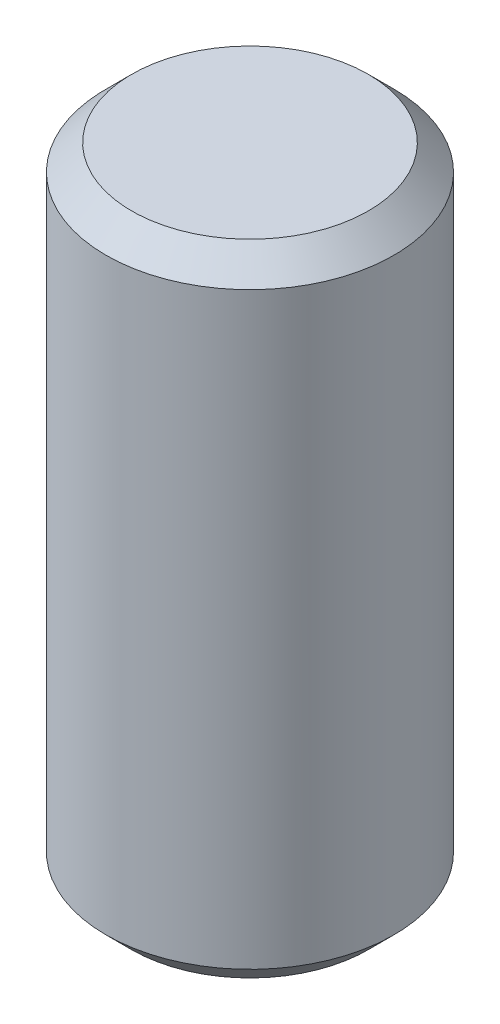
ISO-10303-21;
HEADER;
FILE_DESCRIPTION(('STEP AP214'),'2;1');
FILE_NAME('part.step','',(''),(''),'','','');
FILE_SCHEMA(('AUTOMOTIVE_DESIGN { 1 0 10303 214 1 1 1 1 }'));
ENDSEC;
DATA;
#1=APPLICATION_CONTEXT('core data for automotive mechanical design processes');
#2=APPLICATION_PROTOCOL_DEFINITION('international standard','automotive_design',2000,#1);
#3=PRODUCT_CONTEXT('',#1,'mechanical');
#4=PRODUCT('Part','Part','',(#3));
#5=PRODUCT_RELATED_PRODUCT_CATEGORY('part','',(#4));
#6=PRODUCT_DEFINITION_FORMATION('','',#4);
#7=PRODUCT_DEFINITION_CONTEXT('part definition',#1,'design');
#8=PRODUCT_DEFINITION('design','',#6,#7);
#9=PRODUCT_DEFINITION_SHAPE('','',#8);
#10=(LENGTH_UNIT() NAMED_UNIT(*) SI_UNIT(.MILLI.,.METRE.));
#11=(NAMED_UNIT(*) PLANE_ANGLE_UNIT() SI_UNIT($,.RADIAN.));
#12=(NAMED_UNIT(*) SI_UNIT($,.STERADIAN.) SOLID_ANGLE_UNIT());
#13=UNCERTAINTY_MEASURE_WITH_UNIT(LENGTH_MEASURE(1.E-05),#10,'distance_accuracy_value','');
#14=(GEOMETRIC_REPRESENTATION_CONTEXT(3) GLOBAL_UNCERTAINTY_ASSIGNED_CONTEXT((#13)) GLOBAL_UNIT_ASSIGNED_CONTEXT((#10,
#11,#12)) REPRESENTATION_CONTEXT('',''));
#15=CARTESIAN_POINT('',(0.,0.,0.));
#16=DIRECTION('',(0.,0.,1.));
#17=DIRECTION('',(1.,0.,0.));
#18=AXIS2_PLACEMENT_3D('',#15,#16,#17);
#19=CARTESIAN_POINT('',(0.,-6.35,0.));
#20=DIRECTION('',(0.,1.,0.));
#21=DIRECTION('',(0.,0.,1.));
#22=AXIS2_PLACEMENT_3D('',#19,#20,#21);
#23=PLANE('',#22);
#24=CARTESIAN_POINT('',(0.,-6.35,0.));
#25=DIRECTION('',(0.,1.,0.));
#26=DIRECTION('',(0.,0.,1.));
#27=AXIS2_PLACEMENT_3D('',#24,#25,#26);
#28=CIRCLE('',#27,2.3495);
#29=CARTESIAN_POINT('',(0.,-6.35,2.3495));
#30=VERTEX_POINT('',#29);
#31=EDGE_CURVE('E38',#30,#30,#28,.F.);
#32=ORIENTED_EDGE('',*,*,#31,.T.);
#33=EDGE_LOOP('',(#32));
#34=FACE_BOUND('',#33,.T.);
#35=ADVANCED_FACE('F31',(#34),#23,.F.);
#36=CARTESIAN_POINT('',(0.,6.08020788678209,0.));
#37=DIRECTION('',(0.,1.,0.));
#38=DIRECTION('',(0.,0.,1.));
#39=AXIS2_PLACEMENT_3D('',#36,#37,#38);
#40=CYLINDRICAL_SURFACE('',#39,2.8575);
#41=CARTESIAN_POINT('',(0.,-5.842,0.));
#42=DIRECTION('',(0.,1.,0.));
#43=DIRECTION('',(0.,0.,1.));
#44=AXIS2_PLACEMENT_3D('',#41,#42,#43);
#45=CIRCLE('',#44,2.8575);
#46=CARTESIAN_POINT('',(0.,-5.842,2.8575));
#47=VERTEX_POINT('',#46);
#48=EDGE_CURVE('E42',#47,#47,#45,.T.);
#49=ORIENTED_EDGE('',*,*,#48,.T.);
#50=EDGE_LOOP('',(#49));
#51=FACE_BOUND('',#50,.T.);
#52=CARTESIAN_POINT('',(0.,5.842,0.));
#53=DIRECTION('',(0.,-1.,0.));
#54=DIRECTION('',(0.,0.,-1.));
#55=AXIS2_PLACEMENT_3D('',#52,#53,#54);
#56=CIRCLE('',#55,2.8575);
#57=CARTESIAN_POINT('',(0.,5.842,-2.8575));
#58=VERTEX_POINT('',#57);
#59=EDGE_CURVE('E46',#58,#58,#56,.T.);
#60=ORIENTED_EDGE('',*,*,#59,.T.);
#61=EDGE_LOOP('',(#60));
#62=FACE_BOUND('',#61,.T.);
#63=ADVANCED_FACE('F52',(#51,#62),#40,.T.);
#64=CARTESIAN_POINT('',(2.8575,6.35,0.));
#65=DIRECTION('',(0.,-1.,0.));
#66=DIRECTION('',(0.,0.,-1.));
#67=AXIS2_PLACEMENT_3D('',#64,#65,#66);
#68=PLANE('',#67);
#69=CARTESIAN_POINT('',(0.,6.35,0.));
#70=DIRECTION('',(0.,-1.,0.));
#71=DIRECTION('',(0.,0.,-1.));
#72=AXIS2_PLACEMENT_3D('',#69,#70,#71);
#73=CIRCLE('',#72,2.3495);
#74=CARTESIAN_POINT('',(0.,6.35,-2.3495));
#75=VERTEX_POINT('',#74);
#76=EDGE_CURVE('E10',#75,#75,#73,.F.);
#77=ORIENTED_EDGE('',*,*,#76,.T.);
#78=EDGE_LOOP('',(#77));
#79=FACE_BOUND('',#78,.T.);
#80=ADVANCED_FACE('F60',(#79),#68,.F.);
#81=CARTESIAN_POINT('',(0.,-5.842,0.));
#82=DIRECTION('',(0.,1.,0.));
#83=DIRECTION('',(0.,0.,1.));
#84=AXIS2_PLACEMENT_3D('',#81,#82,#83);
#85=CONICAL_SURFACE('',#84,2.8575,0.785398163397449);
#86=ORIENTED_EDGE('',*,*,#31,.F.);
#87=EDGE_LOOP('',(#86));
#88=FACE_BOUND('',#87,.T.);
#89=ORIENTED_EDGE('',*,*,#48,.F.);
#90=EDGE_LOOP('',(#89));
#91=FACE_BOUND('',#90,.T.);
#92=ADVANCED_FACE('F56',(#88,#91),#85,.T.);
#93=CARTESIAN_POINT('',(0.,6.35,0.));
#94=DIRECTION('',(0.,-1.,0.));
#95=DIRECTION('',(0.,0.,-1.));
#96=AXIS2_PLACEMENT_3D('',#93,#94,#95);
#97=CONICAL_SURFACE('',#96,2.3495,0.785398163397447);
#98=ORIENTED_EDGE('',*,*,#59,.F.);
#99=EDGE_LOOP('',(#98));
#100=FACE_BOUND('',#99,.T.);
#101=ORIENTED_EDGE('',*,*,#76,.F.);
#102=EDGE_LOOP('',(#101));
#103=FACE_BOUND('',#102,.T.);
#104=ADVANCED_FACE('F33',(#100,#103),#97,.T.);
#105=CLOSED_SHELL('',(#35,#63,#80,#92,#104));
#106=MANIFOLD_SOLID_BREP('B2',#105);
#107=ADVANCED_BREP_SHAPE_REPRESENTATION('',(#18,#106),#14);
#108=SHAPE_DEFINITION_REPRESENTATION(#9,#107);
ENDSEC;
END-ISO-10303-21;
